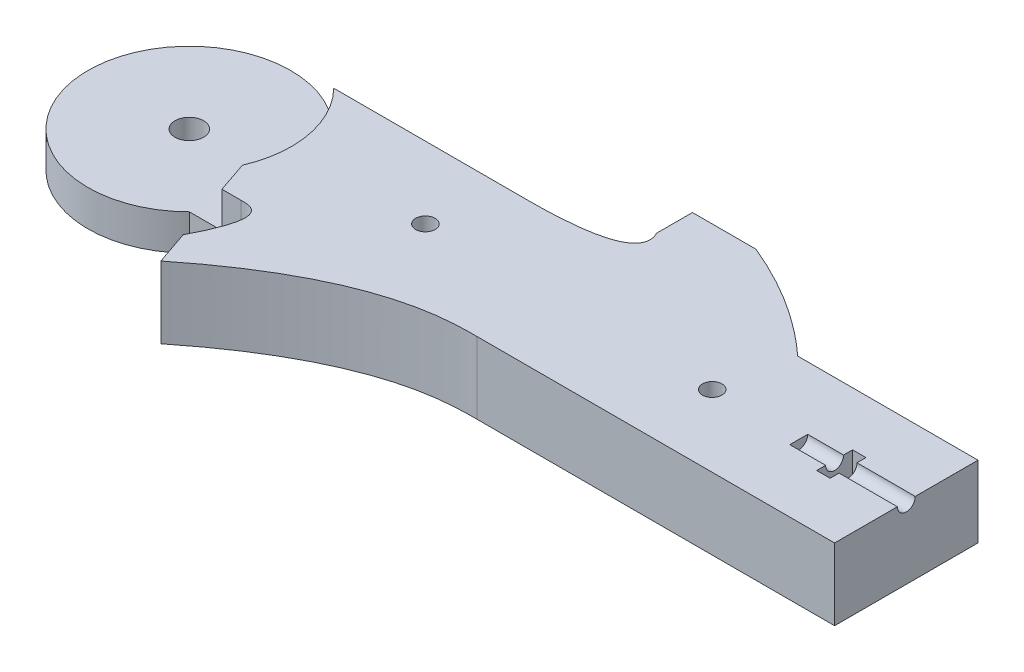
ISO-10303-21;
HEADER;
FILE_DESCRIPTION(('STEP AP214'),'2;1');
FILE_NAME('part.step','',(''),(''),'','','');
FILE_SCHEMA(('AUTOMOTIVE_DESIGN { 1 0 10303 214 1 1 1 1 }'));
ENDSEC;
DATA;
#1=APPLICATION_CONTEXT('core data for automotive mechanical design processes');
#2=APPLICATION_PROTOCOL_DEFINITION('international standard','automotive_design',2000,#1);
#3=PRODUCT_CONTEXT('',#1,'mechanical');
#4=PRODUCT('Part','Part','',(#3));
#5=PRODUCT_RELATED_PRODUCT_CATEGORY('part','',(#4));
#6=PRODUCT_DEFINITION_FORMATION('','',#4);
#7=PRODUCT_DEFINITION_CONTEXT('part definition',#1,'design');
#8=PRODUCT_DEFINITION('design','',#6,#7);
#9=PRODUCT_DEFINITION_SHAPE('','',#8);
#10=(LENGTH_UNIT() NAMED_UNIT(*) SI_UNIT(.MILLI.,.METRE.));
#11=(NAMED_UNIT(*) PLANE_ANGLE_UNIT() SI_UNIT($,.RADIAN.));
#12=(NAMED_UNIT(*) SI_UNIT($,.STERADIAN.) SOLID_ANGLE_UNIT());
#13=UNCERTAINTY_MEASURE_WITH_UNIT(LENGTH_MEASURE(1.E-05),#10,'distance_accuracy_value','');
#14=(GEOMETRIC_REPRESENTATION_CONTEXT(3) GLOBAL_UNCERTAINTY_ASSIGNED_CONTEXT((#13)) GLOBAL_UNIT_ASSIGNED_CONTEXT((#10,
#11,#12)) REPRESENTATION_CONTEXT('',''));
#15=CARTESIAN_POINT('',(0.,0.,0.));
#16=DIRECTION('',(0.,0.,1.));
#17=DIRECTION('',(1.,0.,0.));
#18=AXIS2_PLACEMENT_3D('',#15,#16,#17);
#19=CARTESIAN_POINT('',(-56.5620370370371,12.7,-6.10151852993586));
#20=DIRECTION('',(0.,0.,1.));
#21=DIRECTION('',(1.,0.,0.));
#22=AXIS2_PLACEMENT_3D('',#19,#20,#21);
#23=PLANE('',#22);
#24=DIRECTION('',(0.,1.,0.));
#25=VECTOR('',#24,1.);
#26=CARTESIAN_POINT('',(-22.0521428441884,-49.5130237421217,-6.10151852993586));
#27=LINE('',#26,#25);
#28=CARTESIAN_POINT('',(-22.0521428441884,0.,-6.10151852993586));
#29=VERTEX_POINT('',#28);
#30=CARTESIAN_POINT('',(-22.0521428441884,12.7,-6.10151852993586));
#31=VERTEX_POINT('',#30);
#32=EDGE_CURVE('E211',#29,#31,#27,.T.);
#33=ORIENTED_EDGE('',*,*,#32,.F.);
#34=DIRECTION('',(-1.,0.,0.));
#35=VECTOR('',#34,1.);
#36=CARTESIAN_POINT('',(-56.5620370370371,0.,-6.10151852993586));
#37=LINE('',#36,#35);
#38=CARTESIAN_POINT('',(-56.5620370370371,0.,-6.10151852993586));
#39=VERTEX_POINT('',#38);
#40=EDGE_CURVE('E410',#29,#39,#37,.T.);
#41=ORIENTED_EDGE('',*,*,#40,.T.);
#42=DIRECTION('',(0.,-1.,0.));
#43=VECTOR('',#42,1.);
#44=CARTESIAN_POINT('',(-56.5620370370371,12.7,-6.10151852993586));
#45=LINE('',#44,#43);
#46=CARTESIAN_POINT('',(-56.5620370370371,6.35,-6.10151852993585));
#47=VERTEX_POINT('',#46);
#48=EDGE_CURVE('E426',#47,#39,#45,.T.);
#49=ORIENTED_EDGE('',*,*,#48,.F.);
#50=DIRECTION('',(-1.,0.,0.));
#51=VECTOR('',#50,1.);
#52=CARTESIAN_POINT('',(-56.5620370370371,6.35,-6.10151852993586));
#53=LINE('',#52,#51);
#54=CARTESIAN_POINT('',(-56.3690348168402,6.35,-6.10151852993586));
#55=VERTEX_POINT('',#54);
#56=EDGE_CURVE('E386',#55,#47,#53,.T.);
#57=ORIENTED_EDGE('',*,*,#56,.F.);
#58=DIRECTION('',(0.,1.,0.));
#59=VECTOR('',#58,1.);
#60=CARTESIAN_POINT('',(-56.3690348168402,6.35,-6.10151852993586));
#61=LINE('',#60,#59);
#62=CARTESIAN_POINT('',(-56.3690348168402,12.7,-6.10151852993586));
#63=VERTEX_POINT('',#62);
#64=EDGE_CURVE('E389',#55,#63,#61,.T.);
#65=ORIENTED_EDGE('',*,*,#64,.T.);
#66=DIRECTION('',(-1.,0.,0.));
#67=VECTOR('',#66,1.);
#68=CARTESIAN_POINT('',(-56.5620370370371,12.7,-6.10151852993586));
#69=LINE('',#68,#67);
#70=EDGE_CURVE('E399',#31,#63,#69,.T.);
#71=ORIENTED_EDGE('',*,*,#70,.F.);
#72=EDGE_LOOP('',(#33,#41,#49,#57,#65,#71));
#73=FACE_BOUND('',#72,.T.);
#74=ADVANCED_FACE('F37',(#73),#23,.F.);
#75=DIRECTION('',(0.,1.,0.));
#76=VECTOR('',#75,1.);
#77=CARTESIAN_POINT('',(25.8044086413491,-49.5130237421217,-6.10151852993586));
#78=LINE('',#77,#76);
#79=CARTESIAN_POINT('',(25.8044086413491,0.,-6.10151852993586));
#80=VERTEX_POINT('',#79);
#81=CARTESIAN_POINT('',(25.8044086413491,12.7,-6.10151852993586));
#82=VERTEX_POINT('',#81);
#83=EDGE_CURVE('E247',#80,#82,#78,.T.);
#84=ORIENTED_EDGE('',*,*,#83,.T.);
#85=CARTESIAN_POINT('',(57.7379629629629,12.7,-6.10151852993586));
#86=VERTEX_POINT('',#85);
#87=EDGE_CURVE('E401',#86,#82,#69,.T.);
#88=ORIENTED_EDGE('',*,*,#87,.F.);
#89=DIRECTION('',(0.,-1.,0.));
#90=VECTOR('',#89,1.);
#91=CARTESIAN_POINT('',(57.7379629629629,12.7,-6.10151852993586));
#92=LINE('',#91,#90);
#93=CARTESIAN_POINT('',(57.7379629629629,0.,-6.10151852993586));
#94=VERTEX_POINT('',#93);
#95=EDGE_CURVE('E429',#86,#94,#92,.T.);
#96=ORIENTED_EDGE('',*,*,#95,.T.);
#97=EDGE_CURVE('E411',#94,#80,#37,.T.);
#98=ORIENTED_EDGE('',*,*,#97,.T.);
#99=EDGE_LOOP('',(#84,#88,#96,#98));
#100=FACE_BOUND('',#99,.T.);
#101=ADVANCED_FACE('F496',(#100),#23,.F.);
#102=CARTESIAN_POINT('',(-56.5620370370371,12.7,19.2984814700641));
#103=DIRECTION('',(0.,0.,-1.));
#104=DIRECTION('',(-1.,0.,0.));
#105=AXIS2_PLACEMENT_3D('',#102,#103,#104);
#106=PLANE('',#105);
#107=DIRECTION('',(0.,1.,0.));
#108=VECTOR('',#107,1.);
#109=CARTESIAN_POINT('',(-5.57588640904783,-44.9106074814327,19.2984814700641));
#110=LINE('',#109,#108);
#111=CARTESIAN_POINT('',(-5.57588640904783,0.,19.2984814700641));
#112=VERTEX_POINT('',#111);
#113=CARTESIAN_POINT('',(-5.57588640904783,12.7,19.2984814700641));
#114=VERTEX_POINT('',#113);
#115=EDGE_CURVE('E615',#112,#114,#110,.T.);
#116=ORIENTED_EDGE('',*,*,#115,.F.);
#117=DIRECTION('',(1.,0.,0.));
#118=VECTOR('',#117,1.);
#119=CARTESIAN_POINT('',(-56.5620370370371,0.,19.2984814700641));
#120=LINE('',#119,#118);
#121=CARTESIAN_POINT('',(57.7379629629629,0.,19.2984814700641));
#122=VERTEX_POINT('',#121);
#123=EDGE_CURVE('E417',#112,#122,#120,.T.);
#124=ORIENTED_EDGE('',*,*,#123,.T.);
#125=DIRECTION('',(0.,-1.,0.));
#126=VECTOR('',#125,1.);
#127=CARTESIAN_POINT('',(57.7379629629629,12.7,19.2984814700641));
#128=LINE('',#127,#126);
#129=CARTESIAN_POINT('',(57.7379629629629,12.7,19.2984814700641));
#130=VERTEX_POINT('',#129);
#131=EDGE_CURVE('E408',#130,#122,#128,.T.);
#132=ORIENTED_EDGE('',*,*,#131,.F.);
#133=DIRECTION('',(1.,0.,0.));
#134=VECTOR('',#133,1.);
#135=CARTESIAN_POINT('',(-56.5620370370371,12.7,19.2984814700641));
#136=LINE('',#135,#134);
#137=EDGE_CURVE('E404',#114,#130,#136,.T.);
#138=ORIENTED_EDGE('',*,*,#137,.F.);
#139=EDGE_LOOP('',(#116,#124,#132,#138));
#140=FACE_BOUND('',#139,.T.);
#141=ADVANCED_FACE('F501',(#140),#106,.F.);
#142=CARTESIAN_POINT('',(38.6879629629629,12.7,6.59848147006414));
#143=DIRECTION('',(1.,0.,0.));
#144=DIRECTION('',(0.,0.,-1.));
#145=AXIS2_PLACEMENT_3D('',#142,#143,#144);
#146=CYLINDRICAL_SURFACE('',#145,1.5875);
#147=DIRECTION('',(1.,0.,0.));
#148=VECTOR('',#147,1.);
#149=CARTESIAN_POINT('',(38.6879629629629,12.7,8.18598147006414));
#150=LINE('',#149,#148);
#151=CARTESIAN_POINT('',(45.0379629629629,12.7,8.18598147006414));
#152=VERTEX_POINT('',#151);
#153=CARTESIAN_POINT('',(38.6879629629629,12.7,8.18598147006414));
#154=VERTEX_POINT('',#153);
#155=EDGE_CURVE('E344',#152,#154,#150,.F.);
#156=ORIENTED_EDGE('',*,*,#155,.F.);
#157=CARTESIAN_POINT('',(45.0379629629629,12.7,6.59848147006414));
#158=DIRECTION('',(-1.,0.,0.));
#159=DIRECTION('',(0.,0.,1.));
#160=AXIS2_PLACEMENT_3D('',#157,#158,#159);
#161=CIRCLE('',#160,1.5875);
#162=CARTESIAN_POINT('',(45.0379629629629,12.7,5.01098147006415));
#163=VERTEX_POINT('',#162);
#164=EDGE_CURVE('E11',#152,#163,#161,.F.);
#165=ORIENTED_EDGE('',*,*,#164,.T.);
#166=DIRECTION('',(1.,0.,0.));
#167=VECTOR('',#166,1.);
#168=CARTESIAN_POINT('',(38.6879629629629,12.7,5.01098147006414));
#169=LINE('',#168,#167);
#170=CARTESIAN_POINT('',(38.6879629629629,12.7,5.01098147006414));
#171=VERTEX_POINT('',#170);
#172=EDGE_CURVE('E349',#171,#163,#169,.T.);
#173=ORIENTED_EDGE('',*,*,#172,.F.);
#174=CARTESIAN_POINT('',(38.6879629629629,12.7,6.59848147006414));
#175=DIRECTION('',(1.,0.,0.));
#176=DIRECTION('',(0.,0.,-1.));
#177=AXIS2_PLACEMENT_3D('',#174,#175,#176);
#178=CIRCLE('',#177,1.5875);
#179=EDGE_CURVE('E341',#154,#171,#178,.T.);
#180=ORIENTED_EDGE('',*,*,#179,.F.);
#181=EDGE_LOOP('',(#156,#165,#173,#180));
#182=FACE_BOUND('',#181,.T.);
#183=ADVANCED_FACE('F479',(#182),#146,.F.);
#184=CARTESIAN_POINT('',(-69.262037037037,12.7,6.59848147006414));
#185=DIRECTION('',(0.,-1.,0.));
#186=DIRECTION('',(0.,0.,-1.));
#187=AXIS2_PLACEMENT_3D('',#184,#185,#186);
#188=CYLINDRICAL_SURFACE('',#187,17.9605122421383);
#189=CARTESIAN_POINT('',(-69.262037037037,6.35,6.59848147006414));
#190=DIRECTION('',(0.,1.,0.));
#191=DIRECTION('',(0.,0.,1.));
#192=AXIS2_PLACEMENT_3D('',#189,#190,#191);
#193=CIRCLE('',#192,17.9605122421383);
#194=CARTESIAN_POINT('',(-56.5620370370371,6.35,19.2984814700641));
#195=VERTEX_POINT('',#194);
#196=EDGE_CURVE('E383',#47,#195,#193,.T.);
#197=ORIENTED_EDGE('',*,*,#196,.F.);
#198=ORIENTED_EDGE('',*,*,#48,.T.);
#199=CARTESIAN_POINT('',(-69.262037037037,0.,6.59848147006414));
#200=DIRECTION('',(0.,1.,0.));
#201=DIRECTION('',(0.,0.,-1.));
#202=AXIS2_PLACEMENT_3D('',#199,#200,#201);
#203=CIRCLE('',#202,17.9605122421383);
#204=CARTESIAN_POINT('',(-56.5620370370371,0.,19.2984814700641));
#205=VERTEX_POINT('',#204);
#206=EDGE_CURVE('E414',#39,#205,#203,.T.);
#207=ORIENTED_EDGE('',*,*,#206,.T.);
#208=DIRECTION('',(0.,-1.,0.));
#209=VECTOR('',#208,1.);
#210=CARTESIAN_POINT('',(-56.5620370370371,12.7,19.2984814700641));
#211=LINE('',#210,#209);
#212=EDGE_CURVE('E423',#195,#205,#211,.T.);
#213=ORIENTED_EDGE('',*,*,#212,.F.);
#214=EDGE_LOOP('',(#197,#198,#207,#213));
#215=FACE_BOUND('',#214,.T.);
#216=ADVANCED_FACE('F504',(#215),#188,.T.);
#217=CARTESIAN_POINT('',(-69.262037037037,12.7,6.59848147006414));
#218=DIRECTION('',(0.,-1.,0.));
#219=DIRECTION('',(0.,0.,-1.));
#220=AXIS2_PLACEMENT_3D('',#217,#218,#219);
#221=CYLINDRICAL_SURFACE('',#220,2.54);
#222=CARTESIAN_POINT('',(-69.262037037037,0.,6.59848147006414));
#223=DIRECTION('',(0.,1.,0.));
#224=DIRECTION('',(0.,0.,1.));
#225=AXIS2_PLACEMENT_3D('',#222,#223,#224);
#226=CIRCLE('',#225,2.54);
#227=CARTESIAN_POINT('',(-69.262037037037,0.,9.13848147006414));
#228=VERTEX_POINT('',#227);
#229=EDGE_CURVE('E392',#228,#228,#226,.T.);
#230=ORIENTED_EDGE('',*,*,#229,.F.);
#231=EDGE_LOOP('',(#230));
#232=FACE_BOUND('',#231,.T.);
#233=CARTESIAN_POINT('',(-69.262037037037,6.35,6.59848147006414));
#234=DIRECTION('',(0.,1.,0.));
#235=DIRECTION('',(0.,0.,1.));
#236=AXIS2_PLACEMENT_3D('',#233,#234,#235);
#237=CIRCLE('',#236,2.54);
#238=CARTESIAN_POINT('',(-69.262037037037,6.35,9.13848147006414));
#239=VERTEX_POINT('',#238);
#240=EDGE_CURVE('E378',#239,#239,#237,.T.);
#241=ORIENTED_EDGE('',*,*,#240,.T.);
#242=EDGE_LOOP('',(#241));
#243=FACE_BOUND('',#242,.T.);
#244=ADVANCED_FACE('F507',(#232,#243),#221,.F.);
#245=CARTESIAN_POINT('',(-69.262037037037,12.7,6.59848147006414));
#246=DIRECTION('',(0.,-1.,0.));
#247=DIRECTION('',(0.,0.,-1.));
#248=AXIS2_PLACEMENT_3D('',#245,#246,#247);
#249=PLANE('',#248);
#250=CARTESIAN_POINT('',(-27.4422931581062,12.7,6.59848147006414));
#251=DIRECTION('',(0.,-1.,0.));
#252=DIRECTION('',(0.,0.,-1.));
#253=AXIS2_PLACEMENT_3D('',#250,#251,#252);
#254=CIRCLE('',#253,1.72720000000001);
#255=CARTESIAN_POINT('',(-27.4422931581062,12.7,4.87128147006413));
#256=VERTEX_POINT('',#255);
#257=EDGE_CURVE('E360',#256,#256,#254,.T.);
#258=ORIENTED_EDGE('',*,*,#257,.T.);
#259=EDGE_LOOP('',(#258));
#260=FACE_BOUND('',#259,.T.);
#261=CARTESIAN_POINT('',(23.3577068418938,12.7,6.59848147006414));
#262=DIRECTION('',(0.,-1.,0.));
#263=DIRECTION('',(0.,0.,-1.));
#264=AXIS2_PLACEMENT_3D('',#261,#262,#263);
#265=CIRCLE('',#264,1.72720000000001);
#266=CARTESIAN_POINT('',(23.3577068418938,12.7,4.87128147006413));
#267=VERTEX_POINT('',#266);
#268=EDGE_CURVE('E372',#267,#267,#265,.T.);
#269=ORIENTED_EDGE('',*,*,#268,.T.);
#270=EDGE_LOOP('',(#269));
#271=FACE_BOUND('',#270,.T.);
#272=ORIENTED_EDGE('',*,*,#172,.T.);
#273=DIRECTION('',(0.,0.,1.));
#274=VECTOR('',#273,1.);
#275=CARTESIAN_POINT('',(45.0379629629629,12.7,9.77348147006416));
#276=LINE('',#275,#274);
#277=CARTESIAN_POINT('',(45.0379629629629,12.7,3.42348147006413));
#278=VERTEX_POINT('',#277);
#279=EDGE_CURVE('E321',#278,#163,#276,.T.);
#280=ORIENTED_EDGE('',*,*,#279,.F.);
#281=DIRECTION('',(-1.,0.,0.));
#282=VECTOR('',#281,1.);
#283=CARTESIAN_POINT('',(45.0379629629629,12.7,3.42348147006413));
#284=LINE('',#283,#282);
#285=CARTESIAN_POINT('',(47.4192129629629,12.7,3.42348147006413));
#286=VERTEX_POINT('',#285);
#287=EDGE_CURVE('E317',#286,#278,#284,.T.);
#288=ORIENTED_EDGE('',*,*,#287,.F.);
#289=DIRECTION('',(0.,0.,-1.));
#290=VECTOR('',#289,1.);
#291=CARTESIAN_POINT('',(47.4192129629629,12.7,3.42348147006413));
#292=LINE('',#291,#290);
#293=CARTESIAN_POINT('',(47.4192129629629,12.7,5.01098147006414));
#294=VERTEX_POINT('',#293);
#295=EDGE_CURVE('E312',#294,#286,#292,.T.);
#296=ORIENTED_EDGE('',*,*,#295,.F.);
#297=CARTESIAN_POINT('',(57.7379629629629,12.7,5.01098147006414));
#298=VERTEX_POINT('',#297);
#299=EDGE_CURVE('E348',#294,#298,#169,.T.);
#300=ORIENTED_EDGE('',*,*,#299,.T.);
#301=DIRECTION('',(0.,0.,-1.));
#302=VECTOR('',#301,1.);
#303=CARTESIAN_POINT('',(57.7379629629629,12.7,-6.10151852993586));
#304=LINE('',#303,#302);
#305=EDGE_CURVE('E400',#298,#86,#304,.T.);
#306=ORIENTED_EDGE('',*,*,#305,.T.);
#307=ORIENTED_EDGE('',*,*,#87,.T.);
#308=CARTESIAN_POINT('',(5.68711721311388,12.7,-18.8015185299359));
#309=CARTESIAN_POINT('',(17.0941996057411,12.7,-14.1176448631186));
#310=CARTESIAN_POINT('',(25.8044086413491,12.7,-6.10151852993586));
#311=B_SPLINE_CURVE_WITH_KNOTS('',2,(#308,#309,#310),.UNSPECIFIED.,.F.,.F.,(3,3),(0.,
0.7699329234087),.UNSPECIFIED.);
#312=CARTESIAN_POINT('',(5.68711721311388,12.7,-18.8015185299359));
#313=VERTEX_POINT('',#312);
#314=EDGE_CURVE('E244',#313,#82,#311,.T.);
#315=ORIENTED_EDGE('',*,*,#314,.F.);
#316=DIRECTION('',(1.,0.,0.));
#317=VECTOR('',#316,1.);
#318=CARTESIAN_POINT('',(-5.54086763995443,12.7,-18.8015185299359));
#319=LINE('',#318,#317);
#320=CARTESIAN_POINT('',(-5.54086763995443,12.7,-18.8015185299359));
#321=VERTEX_POINT('',#320);
#322=EDGE_CURVE('E207',#321,#313,#319,.T.);
#323=ORIENTED_EDGE('',*,*,#322,.F.);
#324=DIRECTION('',(0.,0.,-1.));
#325=VECTOR('',#324,1.);
#326=CARTESIAN_POINT('',(-5.54086763995443,12.7,-12.4515185299359));
#327=LINE('',#326,#325);
#328=CARTESIAN_POINT('',(-5.54086763995443,12.7,-12.4515185299359));
#329=VERTEX_POINT('',#328);
#330=EDGE_CURVE('E203',#329,#321,#327,.T.);
#331=ORIENTED_EDGE('',*,*,#330,.F.);
#332=CARTESIAN_POINT('',(-5.54086763995443,12.7,-12.4515185299359));
#333=CARTESIAN_POINT('',(-2.45676013605589,12.7,-6.10151852993586));
#334=CARTESIAN_POINT('',(-22.0521428441884,12.7,-6.10151852993586));
#335=B_SPLINE_CURVE_WITH_KNOTS('',2,(#332,#333,#334),.UNSPECIFIED.,.F.,.F.,(3,3),(0.,1.),.UNSPECIFIED.);
#336=EDGE_CURVE('E60',#329,#31,#335,.T.);
#337=ORIENTED_EDGE('',*,*,#336,.T.);
#338=ORIENTED_EDGE('',*,*,#70,.T.);
#339=CARTESIAN_POINT('',(-69.262037037037,12.7,6.59848147006414));
#340=DIRECTION('',(0.,1.,0.));
#341=DIRECTION('',(0.,0.,1.));
#342=AXIS2_PLACEMENT_3D('',#339,#340,#341);
#343=CIRCLE('',#342,18.0975);
#344=CARTESIAN_POINT('',(-52.6576296854306,12.7,13.796617531012));
#345=VERTEX_POINT('',#344);
#346=EDGE_CURVE('E375',#345,#63,#343,.T.);
#347=ORIENTED_EDGE('',*,*,#346,.F.);
#348=DIRECTION('',(-0.322805874294675,0.,-0.946465196148728));
#349=VECTOR('',#348,1.);
#350=CARTESIAN_POINT('',(-50.7811380761005,12.7,19.2984814700641));
#351=LINE('',#350,#349);
#352=CARTESIAN_POINT('',(-50.7811380761005,12.7,19.2984814700641));
#353=VERTEX_POINT('',#352);
#354=EDGE_CURVE('E332',#353,#345,#351,.T.);
#355=ORIENTED_EDGE('',*,*,#354,.F.);
#356=CARTESIAN_POINT('',(-47.3781705248904,12.7,19.2984814700641));
#357=VERTEX_POINT('',#356);
#358=EDGE_CURVE('E405',#353,#357,#136,.T.);
#359=ORIENTED_EDGE('',*,*,#358,.T.);
#360=CARTESIAN_POINT('',(-47.2315525581981,12.7,29.7058483148863));
#361=CARTESIAN_POINT('',(-41.7251153372007,12.7,19.2984814700641));
#362=CARTESIAN_POINT('',(-45.408751787825,12.7,19.2984814700641));
#363=CARTESIAN_POINT('',(-47.3781705248904,12.7,19.2984814700641));
#364=B_SPLINE_CURVE_WITH_KNOTS('',3,(#360,#361,#362,#363),.UNSPECIFIED.,.F.,.F.,(4,4),(0.,1.),.UNSPECIFIED.);
#365=CARTESIAN_POINT('',(-47.2315525581981,12.7,29.7058483148863));
#366=VERTEX_POINT('',#365);
#367=EDGE_CURVE('E597',#366,#357,#364,.T.);
#368=ORIENTED_EDGE('',*,*,#367,.F.);
#369=DIRECTION('',(-0.322805874294675,0.,-0.946465196148728));
#370=VECTOR('',#369,1.);
#371=CARTESIAN_POINT('',(-45.1817352564269,12.7,35.7159023104307));
#372=LINE('',#371,#370);
#373=CARTESIAN_POINT('',(-45.1817352564269,12.7,35.7159023104307));
#374=VERTEX_POINT('',#373);
#375=EDGE_CURVE('E313',#374,#366,#372,.T.);
#376=ORIENTED_EDGE('',*,*,#375,.F.);
#377=CARTESIAN_POINT('',(-45.1817352564269,12.7,35.7159023104307));
#378=CARTESIAN_POINT('',(-24.6245664486509,12.7,19.2984814700641));
#379=CARTESIAN_POINT('',(-11.56568916727,12.7,19.2984814700641));
#380=CARTESIAN_POINT('',(-5.57588640904783,12.7,19.2984814700641));
#381=B_SPLINE_CURVE_WITH_KNOTS('',3,(#377,#378,#379,#380),.UNSPECIFIED.,.F.,.F.,(4,4),(0.,1.),.UNSPECIFIED.);
#382=EDGE_CURVE('E605',#374,#114,#381,.T.);
#383=ORIENTED_EDGE('',*,*,#382,.T.);
#384=ORIENTED_EDGE('',*,*,#137,.T.);
#385=CARTESIAN_POINT('',(57.7379629629629,12.7,8.18598147006414));
#386=VERTEX_POINT('',#385);
#387=EDGE_CURVE('E396',#130,#386,#304,.T.);
#388=ORIENTED_EDGE('',*,*,#387,.T.);
#389=CARTESIAN_POINT('',(47.4192129629629,12.7,8.18598147006414));
#390=VERTEX_POINT('',#389);
#391=EDGE_CURVE('E345',#386,#390,#150,.F.);
#392=ORIENTED_EDGE('',*,*,#391,.T.);
#393=CARTESIAN_POINT('',(47.4192129629629,12.7,9.77348147006416));
#394=VERTEX_POINT('',#393);
#395=EDGE_CURVE('E314',#394,#390,#292,.T.);
#396=ORIENTED_EDGE('',*,*,#395,.F.);
#397=DIRECTION('',(1.,0.,0.));
#398=VECTOR('',#397,1.);
#399=CARTESIAN_POINT('',(45.0379629629629,12.7,9.77348147006416));
#400=LINE('',#399,#398);
#401=CARTESIAN_POINT('',(45.0379629629629,12.7,9.77348147006416));
#402=VERTEX_POINT('',#401);
#403=EDGE_CURVE('E309',#402,#394,#400,.T.);
#404=ORIENTED_EDGE('',*,*,#403,.F.);
#405=EDGE_CURVE('E320',#152,#402,#276,.T.);
#406=ORIENTED_EDGE('',*,*,#405,.F.);
#407=ORIENTED_EDGE('',*,*,#155,.T.);
#408=DIRECTION('',(0.,0.,1.));
#409=VECTOR('',#408,1.);
#410=CARTESIAN_POINT('',(38.6879629629629,12.7,6.59848147006414));
#411=LINE('',#410,#409);
#412=EDGE_CURVE('E436',#171,#154,#411,.T.);
#413=ORIENTED_EDGE('',*,*,#412,.F.);
#414=EDGE_LOOP('',(#272,#280,#288,#296,#300,#306,#307,#315,#323,#331,#337,#338,#347,#355,#359,
#368,#376,#383,#384,#388,#392,#396,#404,#406,#407,#413));
#415=FACE_BOUND('',#414,.T.);
#416=ADVANCED_FACE('F215',(#260,#271,#415),#249,.F.);
#417=CARTESIAN_POINT('',(-69.262037037037,0.,6.59848147006414));
#418=DIRECTION('',(0.,-1.,0.));
#419=DIRECTION('',(0.,0.,-1.));
#420=AXIS2_PLACEMENT_3D('',#417,#418,#419);
#421=PLANE('',#420);
#422=CARTESIAN_POINT('',(-27.4422931581062,0.,6.59848147006414));
#423=DIRECTION('',(0.,-1.,0.));
#424=DIRECTION('',(0.,0.,-1.));
#425=AXIS2_PLACEMENT_3D('',#422,#423,#424);
#426=CIRCLE('',#425,3.77062999999999);
#427=CARTESIAN_POINT('',(-27.4422931581062,0.,2.82785147006415));
#428=VERTEX_POINT('',#427);
#429=EDGE_CURVE('E351',#428,#428,#426,.T.);
#430=ORIENTED_EDGE('',*,*,#429,.F.);
#431=EDGE_LOOP('',(#430));
#432=FACE_BOUND('',#431,.T.);
#433=CARTESIAN_POINT('',(23.3577068418938,0.,6.59848147006414));
#434=DIRECTION('',(0.,-1.,0.));
#435=DIRECTION('',(0.,0.,-1.));
#436=AXIS2_PLACEMENT_3D('',#433,#434,#435);
#437=CIRCLE('',#436,3.77062999999999);
#438=CARTESIAN_POINT('',(23.3577068418938,0.,2.82785147006415));
#439=VERTEX_POINT('',#438);
#440=EDGE_CURVE('E363',#439,#439,#437,.T.);
#441=ORIENTED_EDGE('',*,*,#440,.F.);
#442=EDGE_LOOP('',(#441));
#443=FACE_BOUND('',#442,.T.);
#444=DIRECTION('',(0.,0.,-1.));
#445=VECTOR('',#444,1.);
#446=CARTESIAN_POINT('',(57.7379629629629,0.,-6.10151852993586));
#447=LINE('',#446,#445);
#448=EDGE_CURVE('E395',#122,#94,#447,.T.);
#449=ORIENTED_EDGE('',*,*,#448,.F.);
#450=ORIENTED_EDGE('',*,*,#123,.F.);
#451=CARTESIAN_POINT('',(-45.1817352564269,0.,35.7159023104307));
#452=CARTESIAN_POINT('',(-24.6245664486509,0.,19.2984814700641));
#453=CARTESIAN_POINT('',(-11.56568916727,0.,19.2984814700641));
#454=CARTESIAN_POINT('',(-5.57588640904783,0.,19.2984814700641));
#455=B_SPLINE_CURVE_WITH_KNOTS('',3,(#451,#452,#453,#454),.UNSPECIFIED.,.F.,.F.,(4,4),(0.,1.),.UNSPECIFIED.);
#456=CARTESIAN_POINT('',(-45.1817352564269,0.,35.7159023104307));
#457=VERTEX_POINT('',#456);
#458=EDGE_CURVE('E612',#457,#112,#455,.T.);
#459=ORIENTED_EDGE('',*,*,#458,.F.);
#460=DIRECTION('',(-0.322805874294675,0.,-0.946465196148728));
#461=VECTOR('',#460,1.);
#462=CARTESIAN_POINT('',(-45.1817352564269,0.,35.7159023104307));
#463=LINE('',#462,#461);
#464=CARTESIAN_POINT('',(-47.2315525581981,0.,29.7058483148863));
#465=VERTEX_POINT('',#464);
#466=EDGE_CURVE('E218',#457,#465,#463,.T.);
#467=ORIENTED_EDGE('',*,*,#466,.T.);
#468=CARTESIAN_POINT('',(-47.2315525581981,0.,29.7058483148863));
#469=CARTESIAN_POINT('',(-41.7251153372007,0.,19.2984814700641));
#470=CARTESIAN_POINT('',(-45.408751787825,0.,19.2984814700641));
#471=CARTESIAN_POINT('',(-47.3781705248904,0.,19.2984814700641));
#472=B_SPLINE_CURVE_WITH_KNOTS('',3,(#468,#469,#470,#471),.UNSPECIFIED.,.F.,.F.,(4,4),(0.,1.),.UNSPECIFIED.);
#473=CARTESIAN_POINT('',(-47.3781705248904,0.,19.2984814700641));
#474=VERTEX_POINT('',#473);
#475=EDGE_CURVE('E221',#465,#474,#472,.T.);
#476=ORIENTED_EDGE('',*,*,#475,.T.);
#477=EDGE_CURVE('E418',#205,#474,#120,.T.);
#478=ORIENTED_EDGE('',*,*,#477,.F.);
#479=ORIENTED_EDGE('',*,*,#206,.F.);
#480=ORIENTED_EDGE('',*,*,#40,.F.);
#481=CARTESIAN_POINT('',(-5.54086763995443,0.,-12.4515185299359));
#482=CARTESIAN_POINT('',(-2.45676013605589,0.,-6.10151852993586));
#483=CARTESIAN_POINT('',(-22.0521428441884,0.,-6.10151852993586));
#484=B_SPLINE_CURVE_WITH_KNOTS('',2,(#481,#482,#483),.UNSPECIFIED.,.F.,.F.,(3,3),(0.,1.),.UNSPECIFIED.);
#485=CARTESIAN_POINT('',(-5.54086763995443,0.,-12.4515185299359));
#486=VERTEX_POINT('',#485);
#487=EDGE_CURVE('E52',#486,#29,#484,.T.);
#488=ORIENTED_EDGE('',*,*,#487,.F.);
#489=DIRECTION('',(0.,0.,-1.));
#490=VECTOR('',#489,1.);
#491=CARTESIAN_POINT('',(-5.54086763995443,0.,-12.4515185299359));
#492=LINE('',#491,#490);
#493=CARTESIAN_POINT('',(-5.54086763995443,0.,-18.8015185299359));
#494=VERTEX_POINT('',#493);
#495=EDGE_CURVE('E206',#486,#494,#492,.T.);
#496=ORIENTED_EDGE('',*,*,#495,.T.);
#497=DIRECTION('',(1.,0.,0.));
#498=VECTOR('',#497,1.);
#499=CARTESIAN_POINT('',(-5.54086763995443,0.,-18.8015185299359));
#500=LINE('',#499,#498);
#501=CARTESIAN_POINT('',(5.68711721311388,0.,-18.8015185299359));
#502=VERTEX_POINT('',#501);
#503=EDGE_CURVE('E233',#494,#502,#500,.T.);
#504=ORIENTED_EDGE('',*,*,#503,.T.);
#505=CARTESIAN_POINT('',(5.68711721311388,0.,-18.8015185299359));
#506=CARTESIAN_POINT('',(17.0941996057411,0.,-14.1176448631186));
#507=CARTESIAN_POINT('',(25.8044086413491,0.,-6.10151852993586));
#508=B_SPLINE_CURVE_WITH_KNOTS('',2,(#505,#506,#507),.UNSPECIFIED.,.F.,.F.,(3,3),(0.,
0.7699329234087),.UNSPECIFIED.);
#509=EDGE_CURVE('E212',#502,#80,#508,.T.);
#510=ORIENTED_EDGE('',*,*,#509,.T.);
#511=ORIENTED_EDGE('',*,*,#97,.F.);
#512=EDGE_LOOP('',(#449,#450,#459,#467,#476,#478,#479,#480,#488,#496,#504,#510,#511));
#513=FACE_BOUND('',#512,.T.);
#514=ORIENTED_EDGE('',*,*,#229,.T.);
#515=EDGE_LOOP('',(#514));
#516=FACE_BOUND('',#515,.T.);
#517=ADVANCED_FACE('F514',(#432,#443,#513,#516),#421,.T.);
#518=CARTESIAN_POINT('',(57.7379629629629,12.7,-6.10151852993586));
#519=DIRECTION('',(-1.,0.,0.));
#520=DIRECTION('',(0.,0.,1.));
#521=AXIS2_PLACEMENT_3D('',#518,#519,#520);
#522=PLANE('',#521);
#523=ORIENTED_EDGE('',*,*,#305,.F.);
#524=CARTESIAN_POINT('',(57.7379629629629,12.7,6.59848147006414));
#525=DIRECTION('',(-1.,0.,0.));
#526=DIRECTION('',(0.,0.,1.));
#527=AXIS2_PLACEMENT_3D('',#524,#525,#526);
#528=CIRCLE('',#527,1.5875);
#529=EDGE_CURVE('E432',#298,#386,#528,.T.);
#530=ORIENTED_EDGE('',*,*,#529,.T.);
#531=ORIENTED_EDGE('',*,*,#387,.F.);
#532=ORIENTED_EDGE('',*,*,#131,.T.);
#533=ORIENTED_EDGE('',*,*,#448,.T.);
#534=ORIENTED_EDGE('',*,*,#95,.F.);
#535=EDGE_LOOP('',(#523,#530,#531,#532,#533,#534));
#536=FACE_BOUND('',#535,.T.);
#537=ADVANCED_FACE('F39',(#536),#522,.F.);
#538=ORIENTED_EDGE('',*,*,#477,.T.);
#539=DIRECTION('',(0.,1.,0.));
#540=VECTOR('',#539,1.);
#541=CARTESIAN_POINT('',(-47.3781705248904,-44.9106074814327,19.2984814700641));
#542=LINE('',#541,#540);
#543=EDGE_CURVE('E593',#474,#357,#542,.T.);
#544=ORIENTED_EDGE('',*,*,#543,.T.);
#545=ORIENTED_EDGE('',*,*,#358,.F.);
#546=DIRECTION('',(0.,1.,0.));
#547=VECTOR('',#546,1.);
#548=CARTESIAN_POINT('',(-50.7811380761005,-2.73699166155966,19.2984814700641));
#549=LINE('',#548,#547);
#550=CARTESIAN_POINT('',(-50.7811380761005,6.35,19.2984814700641));
#551=VERTEX_POINT('',#550);
#552=EDGE_CURVE('E335',#551,#353,#549,.T.);
#553=ORIENTED_EDGE('',*,*,#552,.F.);
#554=DIRECTION('',(1.,0.,0.));
#555=VECTOR('',#554,1.);
#556=CARTESIAN_POINT('',(-56.5620370370371,6.35,19.2984814700641));
#557=LINE('',#556,#555);
#558=EDGE_CURVE('E380',#195,#551,#557,.T.);
#559=ORIENTED_EDGE('',*,*,#558,.F.);
#560=ORIENTED_EDGE('',*,*,#212,.T.);
#561=EDGE_LOOP('',(#538,#544,#545,#553,#559,#560));
#562=FACE_BOUND('',#561,.T.);
#563=ADVANCED_FACE('F509',(#562),#106,.F.);
#564=CARTESIAN_POINT('',(-69.262037037037,6.35,6.59848147006414));
#565=DIRECTION('',(0.,1.,0.));
#566=DIRECTION('',(0.,0.,1.));
#567=AXIS2_PLACEMENT_3D('',#564,#565,#566);
#568=CYLINDRICAL_SURFACE('',#567,18.0975);
#569=CARTESIAN_POINT('',(-69.262037037037,6.35,6.59848147006414));
#570=DIRECTION('',(0.,1.,0.));
#571=DIRECTION('',(0.,0.,1.));
#572=AXIS2_PLACEMENT_3D('',#569,#570,#571);
#573=CIRCLE('',#572,18.0975);
#574=CARTESIAN_POINT('',(-52.6576296854306,6.35,13.796617531012));
#575=VERTEX_POINT('',#574);
#576=EDGE_CURVE('E376',#575,#55,#573,.T.);
#577=ORIENTED_EDGE('',*,*,#576,.F.);
#578=DIRECTION('',(0.,1.,0.));
#579=VECTOR('',#578,1.);
#580=CARTESIAN_POINT('',(-52.6576296854306,-2.73699166155966,13.796617531012));
#581=LINE('',#580,#579);
#582=EDGE_CURVE('E336',#575,#345,#581,.T.);
#583=ORIENTED_EDGE('',*,*,#582,.T.);
#584=ORIENTED_EDGE('',*,*,#346,.T.);
#585=ORIENTED_EDGE('',*,*,#64,.F.);
#586=EDGE_LOOP('',(#577,#583,#584,#585));
#587=FACE_BOUND('',#586,.T.);
#588=ADVANCED_FACE('F512',(#587),#568,.F.);
#589=CARTESIAN_POINT('',(-69.262037037037,6.35,6.59848147006414));
#590=DIRECTION('',(0.,1.,0.));
#591=DIRECTION('',(0.,0.,1.));
#592=AXIS2_PLACEMENT_3D('',#589,#590,#591);
#593=PLANE('',#592);
#594=ORIENTED_EDGE('',*,*,#196,.T.);
#595=ORIENTED_EDGE('',*,*,#558,.T.);
#596=DIRECTION('',(0.322805874294675,0.,0.946465196148728));
#597=VECTOR('',#596,1.);
#598=CARTESIAN_POINT('',(-50.7811380761005,6.35,19.2984814700641));
#599=LINE('',#598,#597);
#600=EDGE_CURVE('E338',#575,#551,#599,.T.);
#601=ORIENTED_EDGE('',*,*,#600,.F.);
#602=ORIENTED_EDGE('',*,*,#576,.T.);
#603=ORIENTED_EDGE('',*,*,#56,.T.);
#604=EDGE_LOOP('',(#594,#595,#601,#602,#603));
#605=FACE_BOUND('',#604,.T.);
#606=ORIENTED_EDGE('',*,*,#240,.F.);
#607=EDGE_LOOP('',(#606));
#608=FACE_BOUND('',#607,.T.);
#609=ADVANCED_FACE('F526',(#605,#608),#593,.T.);
#610=CARTESIAN_POINT('',(23.3577068418938,0.,6.59848147006414));
#611=DIRECTION('',(0.,-1.,0.));
#612=DIRECTION('',(0.,0.,-1.));
#613=AXIS2_PLACEMENT_3D('',#610,#611,#612);
#614=CYLINDRICAL_SURFACE('',#613,1.7272);
#615=ORIENTED_EDGE('',*,*,#268,.F.);
#616=EDGE_LOOP('',(#615));
#617=FACE_BOUND('',#616,.T.);
#618=CARTESIAN_POINT('',(23.3577068418938,1.9812,6.59848147006414));
#619=DIRECTION('',(0.,-1.,0.));
#620=DIRECTION('',(0.,0.,-1.));
#621=AXIS2_PLACEMENT_3D('',#618,#619,#620);
#622=CIRCLE('',#621,1.7272);
#623=CARTESIAN_POINT('',(23.3577068418938,1.9812,4.87128147006415));
#624=VERTEX_POINT('',#623);
#625=EDGE_CURVE('E369',#624,#624,#622,.T.);
#626=ORIENTED_EDGE('',*,*,#625,.T.);
#627=EDGE_LOOP('',(#626));
#628=FACE_BOUND('',#627,.T.);
#629=ADVANCED_FACE('F530',(#617,#628),#614,.F.);
#630=CARTESIAN_POINT('',(25.0849068418938,1.9812,6.59848147006414));
#631=DIRECTION('',(0.,1.,0.));
#632=DIRECTION('',(0.,0.,1.));
#633=AXIS2_PLACEMENT_3D('',#630,#631,#632);
#634=PLANE('',#633);
#635=ORIENTED_EDGE('',*,*,#625,.F.);
#636=EDGE_LOOP('',(#635));
#637=FACE_BOUND('',#636,.T.);
#638=CARTESIAN_POINT('',(23.3577068418938,1.9812,6.59848147006414));
#639=DIRECTION('',(0.,-1.,0.));
#640=DIRECTION('',(0.,0.,-1.));
#641=AXIS2_PLACEMENT_3D('',#638,#639,#640);
#642=CIRCLE('',#641,3.77063);
#643=CARTESIAN_POINT('',(23.3577068418938,1.9812,2.82785147006415));
#644=VERTEX_POINT('',#643);
#645=EDGE_CURVE('E366',#644,#644,#642,.T.);
#646=ORIENTED_EDGE('',*,*,#645,.T.);
#647=EDGE_LOOP('',(#646));
#648=FACE_BOUND('',#647,.T.);
#649=ADVANCED_FACE('F534',(#637,#648),#634,.F.);
#650=CARTESIAN_POINT('',(23.3577068418938,0.,6.59848147006414));
#651=DIRECTION('',(0.,-1.,0.));
#652=DIRECTION('',(0.,0.,-1.));
#653=AXIS2_PLACEMENT_3D('',#650,#651,#652);
#654=CYLINDRICAL_SURFACE('',#653,3.77063);
#655=ORIENTED_EDGE('',*,*,#645,.F.);
#656=EDGE_LOOP('',(#655));
#657=FACE_BOUND('',#656,.T.);
#658=ORIENTED_EDGE('',*,*,#440,.T.);
#659=EDGE_LOOP('',(#658));
#660=FACE_BOUND('',#659,.T.);
#661=ADVANCED_FACE('F538',(#657,#660),#654,.F.);
#662=CARTESIAN_POINT('',(-27.4422931581062,0.,6.59848147006414));
#663=DIRECTION('',(0.,-1.,0.));
#664=DIRECTION('',(0.,0.,-1.));
#665=AXIS2_PLACEMENT_3D('',#662,#663,#664);
#666=CYLINDRICAL_SURFACE('',#665,1.7272);
#667=ORIENTED_EDGE('',*,*,#257,.F.);
#668=EDGE_LOOP('',(#667));
#669=FACE_BOUND('',#668,.T.);
#670=CARTESIAN_POINT('',(-27.4422931581062,1.9812,6.59848147006414));
#671=DIRECTION('',(0.,-1.,0.));
#672=DIRECTION('',(0.,0.,-1.));
#673=AXIS2_PLACEMENT_3D('',#670,#671,#672);
#674=CIRCLE('',#673,1.7272);
#675=CARTESIAN_POINT('',(-27.4422931581062,1.9812,4.87128147006415));
#676=VERTEX_POINT('',#675);
#677=EDGE_CURVE('E357',#676,#676,#674,.T.);
#678=ORIENTED_EDGE('',*,*,#677,.T.);
#679=EDGE_LOOP('',(#678));
#680=FACE_BOUND('',#679,.T.);
#681=ADVANCED_FACE('F542',(#669,#680),#666,.F.);
#682=CARTESIAN_POINT('',(-25.7150931581062,1.9812,6.59848147006414));
#683=DIRECTION('',(0.,1.,0.));
#684=DIRECTION('',(0.,0.,1.));
#685=AXIS2_PLACEMENT_3D('',#682,#683,#684);
#686=PLANE('',#685);
#687=ORIENTED_EDGE('',*,*,#677,.F.);
#688=EDGE_LOOP('',(#687));
#689=FACE_BOUND('',#688,.T.);
#690=CARTESIAN_POINT('',(-27.4422931581062,1.9812,6.59848147006414));
#691=DIRECTION('',(0.,-1.,0.));
#692=DIRECTION('',(0.,0.,-1.));
#693=AXIS2_PLACEMENT_3D('',#690,#691,#692);
#694=CIRCLE('',#693,3.77063);
#695=CARTESIAN_POINT('',(-27.4422931581062,1.9812,2.82785147006415));
#696=VERTEX_POINT('',#695);
#697=EDGE_CURVE('E354',#696,#696,#694,.T.);
#698=ORIENTED_EDGE('',*,*,#697,.T.);
#699=EDGE_LOOP('',(#698));
#700=FACE_BOUND('',#699,.T.);
#701=ADVANCED_FACE('F491',(#689,#700),#686,.F.);
#702=CARTESIAN_POINT('',(-27.4422931581062,0.,6.59848147006414));
#703=DIRECTION('',(0.,-1.,0.));
#704=DIRECTION('',(0.,0.,-1.));
#705=AXIS2_PLACEMENT_3D('',#702,#703,#704);
#706=CYLINDRICAL_SURFACE('',#705,3.77063);
#707=ORIENTED_EDGE('',*,*,#697,.F.);
#708=EDGE_LOOP('',(#707));
#709=FACE_BOUND('',#708,.T.);
#710=ORIENTED_EDGE('',*,*,#429,.T.);
#711=EDGE_LOOP('',(#710));
#712=FACE_BOUND('',#711,.T.);
#713=ADVANCED_FACE('F483',(#709,#712),#706,.F.);
#714=CARTESIAN_POINT('',(38.6879629629629,12.7,6.59848147006414));
#715=DIRECTION('',(1.,0.,0.));
#716=DIRECTION('',(0.,0.,-1.));
#717=AXIS2_PLACEMENT_3D('',#714,#715,#716);
#718=PLANE('',#717);
#719=ORIENTED_EDGE('',*,*,#412,.T.);
#720=ORIENTED_EDGE('',*,*,#179,.T.);
#721=EDGE_LOOP('',(#719,#720));
#722=FACE_BOUND('',#721,.T.);
#723=ADVANCED_FACE('F481',(#722),#718,.T.);
#724=ORIENTED_EDGE('',*,*,#299,.F.);
#725=CARTESIAN_POINT('',(47.4192129629629,12.7,6.59848147006414));
#726=DIRECTION('',(1.,0.,0.));
#727=DIRECTION('',(0.,0.,-1.));
#728=AXIS2_PLACEMENT_3D('',#725,#726,#727);
#729=CIRCLE('',#728,1.5875);
#730=EDGE_CURVE('E45',#294,#390,#729,.F.);
#731=ORIENTED_EDGE('',*,*,#730,.T.);
#732=ORIENTED_EDGE('',*,*,#391,.F.);
#733=ORIENTED_EDGE('',*,*,#529,.F.);
#734=EDGE_LOOP('',(#724,#731,#732,#733));
#735=FACE_BOUND('',#734,.T.);
#736=ADVANCED_FACE('F440',(#735),#146,.F.);
#737=CARTESIAN_POINT('',(-50.7811380761005,-2.73699166155966,19.2984814700641));
#738=DIRECTION('',(0.946465196148728,0.,-0.322805874294675));
#739=DIRECTION('',(-0.322805874294675,0.,-0.946465196148728));
#740=AXIS2_PLACEMENT_3D('',#737,#738,#739);
#741=PLANE('',#740);
#742=ORIENTED_EDGE('',*,*,#600,.T.);
#743=ORIENTED_EDGE('',*,*,#552,.T.);
#744=ORIENTED_EDGE('',*,*,#354,.T.);
#745=ORIENTED_EDGE('',*,*,#582,.F.);
#746=EDGE_LOOP('',(#742,#743,#744,#745));
#747=FACE_BOUND('',#746,.T.);
#748=ADVANCED_FACE('F489',(#747),#741,.F.);
#749=CARTESIAN_POINT('',(45.0379629629629,-2.73699166155966,9.77348147006416));
#750=DIRECTION('',(-1.,0.,0.));
#751=DIRECTION('',(0.,0.,1.));
#752=AXIS2_PLACEMENT_3D('',#749,#750,#751);
#753=PLANE('',#752);
#754=ORIENTED_EDGE('',*,*,#405,.T.);
#755=DIRECTION('',(0.,1.,0.));
#756=VECTOR('',#755,1.);
#757=CARTESIAN_POINT('',(45.0379629629629,-2.73699166155966,9.77348147006416));
#758=LINE('',#757,#756);
#759=CARTESIAN_POINT('',(45.0379629629629,6.35,9.77348147006416));
#760=VERTEX_POINT('',#759);
#761=EDGE_CURVE('E303',#760,#402,#758,.T.);
#762=ORIENTED_EDGE('',*,*,#761,.F.);
#763=DIRECTION('',(0.,0.,-1.));
#764=VECTOR('',#763,1.);
#765=CARTESIAN_POINT('',(45.0379629629629,6.35,9.77348147006416));
#766=LINE('',#765,#764);
#767=CARTESIAN_POINT('',(45.0379629629629,6.35,3.42348147006413));
#768=VERTEX_POINT('',#767);
#769=EDGE_CURVE('E302',#760,#768,#766,.T.);
#770=ORIENTED_EDGE('',*,*,#769,.T.);
#771=DIRECTION('',(0.,1.,0.));
#772=VECTOR('',#771,1.);
#773=CARTESIAN_POINT('',(45.0379629629629,-2.73699166155966,3.42348147006413));
#774=LINE('',#773,#772);
#775=EDGE_CURVE('E325',#768,#278,#774,.T.);
#776=ORIENTED_EDGE('',*,*,#775,.T.);
#777=ORIENTED_EDGE('',*,*,#279,.T.);
#778=ORIENTED_EDGE('',*,*,#164,.F.);
#779=EDGE_LOOP('',(#754,#762,#770,#776,#777,#778));
#780=FACE_BOUND('',#779,.T.);
#781=ADVANCED_FACE('F475',(#780),#753,.F.);
#782=CARTESIAN_POINT('',(47.4192129629629,-2.73699166155966,3.42348147006413));
#783=DIRECTION('',(1.,0.,0.));
#784=DIRECTION('',(0.,0.,-1.));
#785=AXIS2_PLACEMENT_3D('',#782,#783,#784);
#786=PLANE('',#785);
#787=ORIENTED_EDGE('',*,*,#295,.T.);
#788=DIRECTION('',(0.,1.,0.));
#789=VECTOR('',#788,1.);
#790=CARTESIAN_POINT('',(47.4192129629629,-2.73699166155966,3.42348147006413));
#791=LINE('',#790,#789);
#792=CARTESIAN_POINT('',(47.4192129629629,6.35,3.42348147006413));
#793=VERTEX_POINT('',#792);
#794=EDGE_CURVE('E327',#793,#286,#791,.T.);
#795=ORIENTED_EDGE('',*,*,#794,.F.);
#796=DIRECTION('',(0.,0.,1.));
#797=VECTOR('',#796,1.);
#798=CARTESIAN_POINT('',(47.4192129629629,6.35,3.42348147006413));
#799=LINE('',#798,#797);
#800=CARTESIAN_POINT('',(47.4192129629629,6.35,9.77348147006416));
#801=VERTEX_POINT('',#800);
#802=EDGE_CURVE('E308',#793,#801,#799,.T.);
#803=ORIENTED_EDGE('',*,*,#802,.T.);
#804=DIRECTION('',(0.,1.,0.));
#805=VECTOR('',#804,1.);
#806=CARTESIAN_POINT('',(47.4192129629629,-2.73699166155966,9.77348147006416));
#807=LINE('',#806,#805);
#808=EDGE_CURVE('E323',#801,#394,#807,.T.);
#809=ORIENTED_EDGE('',*,*,#808,.T.);
#810=ORIENTED_EDGE('',*,*,#395,.T.);
#811=ORIENTED_EDGE('',*,*,#730,.F.);
#812=EDGE_LOOP('',(#787,#795,#803,#809,#810,#811));
#813=FACE_BOUND('',#812,.T.);
#814=ADVANCED_FACE('F446',(#813),#786,.F.);
#815=CARTESIAN_POINT('',(45.0379629629629,-2.73699166155966,9.77348147006416));
#816=DIRECTION('',(0.,0.,1.));
#817=DIRECTION('',(1.,0.,0.));
#818=AXIS2_PLACEMENT_3D('',#815,#816,#817);
#819=PLANE('',#818);
#820=DIRECTION('',(-1.,0.,0.));
#821=VECTOR('',#820,1.);
#822=CARTESIAN_POINT('',(45.0379629629629,6.35,9.77348147006416));
#823=LINE('',#822,#821);
#824=EDGE_CURVE('E306',#801,#760,#823,.T.);
#825=ORIENTED_EDGE('',*,*,#824,.T.);
#826=ORIENTED_EDGE('',*,*,#761,.T.);
#827=ORIENTED_EDGE('',*,*,#403,.T.);
#828=ORIENTED_EDGE('',*,*,#808,.F.);
#829=EDGE_LOOP('',(#825,#826,#827,#828));
#830=FACE_BOUND('',#829,.T.);
#831=ADVANCED_FACE('F469',(#830),#819,.F.);
#832=CARTESIAN_POINT('',(45.0379629629629,-2.73699166155966,3.42348147006413));
#833=DIRECTION('',(0.,0.,-1.));
#834=DIRECTION('',(-1.,0.,0.));
#835=AXIS2_PLACEMENT_3D('',#832,#833,#834);
#836=PLANE('',#835);
#837=DIRECTION('',(1.,0.,0.));
#838=VECTOR('',#837,1.);
#839=CARTESIAN_POINT('',(45.0379629629629,6.35,3.42348147006413));
#840=LINE('',#839,#838);
#841=EDGE_CURVE('E297',#768,#793,#840,.T.);
#842=ORIENTED_EDGE('',*,*,#841,.T.);
#843=ORIENTED_EDGE('',*,*,#794,.T.);
#844=ORIENTED_EDGE('',*,*,#287,.T.);
#845=ORIENTED_EDGE('',*,*,#775,.F.);
#846=EDGE_LOOP('',(#842,#843,#844,#845));
#847=FACE_BOUND('',#846,.T.);
#848=ADVANCED_FACE('F462',(#847),#836,.F.);
#849=CARTESIAN_POINT('',(-69.262037037037,6.35,6.59848147006414));
#850=DIRECTION('',(0.,1.,0.));
#851=DIRECTION('',(0.,0.,1.));
#852=AXIS2_PLACEMENT_3D('',#849,#850,#851);
#853=PLANE('',#852);
#854=ORIENTED_EDGE('',*,*,#824,.F.);
#855=ORIENTED_EDGE('',*,*,#802,.F.);
#856=ORIENTED_EDGE('',*,*,#841,.F.);
#857=ORIENTED_EDGE('',*,*,#769,.F.);
#858=EDGE_LOOP('',(#854,#855,#856,#857));
#859=FACE_BOUND('',#858,.T.);
#860=ADVANCED_FACE('F466',(#859),#853,.T.);
#861=CARTESIAN_POINT('',(-45.1817352564269,-44.9106074814327,35.7159023104307));
#862=CARTESIAN_POINT('',(-24.6245664486509,-44.9106074814327,19.2984814700641));
#863=CARTESIAN_POINT('',(-11.56568916727,-44.9106074814327,19.2984814700641));
#864=CARTESIAN_POINT('',(-5.57588640904783,-44.9106074814327,19.2984814700641));
#865=B_SPLINE_CURVE_WITH_KNOTS('',3,(#861,#862,#863,#864),.UNSPECIFIED.,.F.,.F.,(4,4),(0.,1.),.UNSPECIFIED.);
#866=DIRECTION('',(0.,1.,0.));
#867=VECTOR('',#866,1.);
#868=SURFACE_OF_LINEAR_EXTRUSION('',#865,#867);
#869=DIRECTION('',(0.,1.,0.));
#870=VECTOR('',#869,1.);
#871=CARTESIAN_POINT('',(-45.1817352564269,-44.9106074814327,35.7159023104307));
#872=LINE('',#871,#870);
#873=EDGE_CURVE('E288',#457,#374,#872,.T.);
#874=ORIENTED_EDGE('',*,*,#873,.F.);
#875=ORIENTED_EDGE('',*,*,#458,.T.);
#876=ORIENTED_EDGE('',*,*,#115,.T.);
#877=ORIENTED_EDGE('',*,*,#382,.F.);
#878=EDGE_LOOP('',(#874,#875,#876,#877));
#879=FACE_BOUND('',#878,.T.);
#880=ADVANCED_FACE('F280',(#879),#868,.T.);
#881=CARTESIAN_POINT('',(-47.2315525581981,-44.9106074814327,29.7058483148863));
#882=CARTESIAN_POINT('',(-41.7251153372007,-44.9106074814327,19.2984814700641));
#883=CARTESIAN_POINT('',(-45.408751787825,-44.9106074814327,19.2984814700641));
#884=CARTESIAN_POINT('',(-47.3781705248904,-44.9106074814327,19.2984814700641));
#885=B_SPLINE_CURVE_WITH_KNOTS('',3,(#881,#882,#883,#884),.UNSPECIFIED.,.F.,.F.,(4,4),(0.,1.),.UNSPECIFIED.);
#886=DIRECTION('',(0.,1.,0.));
#887=VECTOR('',#886,1.);
#888=SURFACE_OF_LINEAR_EXTRUSION('',#885,#887);
#889=ORIENTED_EDGE('',*,*,#475,.F.);
#890=DIRECTION('',(0.,1.,0.));
#891=VECTOR('',#890,1.);
#892=CARTESIAN_POINT('',(-47.2315525581981,-44.9106074814327,29.7058483148863));
#893=LINE('',#892,#891);
#894=EDGE_CURVE('E599',#465,#366,#893,.T.);
#895=ORIENTED_EDGE('',*,*,#894,.T.);
#896=ORIENTED_EDGE('',*,*,#367,.T.);
#897=ORIENTED_EDGE('',*,*,#543,.F.);
#898=EDGE_LOOP('',(#889,#895,#896,#897));
#899=FACE_BOUND('',#898,.T.);
#900=ADVANCED_FACE('F275',(#899),#888,.F.);
#901=CARTESIAN_POINT('',(-45.1817352564269,-44.9106074814327,35.7159023104307));
#902=DIRECTION('',(0.946465196148728,0.,-0.322805874294675));
#903=DIRECTION('',(-0.322805874294675,0.,-0.946465196148728));
#904=AXIS2_PLACEMENT_3D('',#901,#902,#903);
#905=PLANE('',#904);
#906=ORIENTED_EDGE('',*,*,#466,.F.);
#907=ORIENTED_EDGE('',*,*,#873,.T.);
#908=ORIENTED_EDGE('',*,*,#375,.T.);
#909=ORIENTED_EDGE('',*,*,#894,.F.);
#910=EDGE_LOOP('',(#906,#907,#908,#909));
#911=FACE_BOUND('',#910,.T.);
#912=ADVANCED_FACE('F272',(#911),#905,.F.);
#913=CARTESIAN_POINT('',(-5.54086763995443,-49.5130237421217,-12.4515185299359));
#914=CARTESIAN_POINT('',(-2.45676013605589,-49.5130237421217,-6.10151852993586));
#915=CARTESIAN_POINT('',(-22.0521428441884,-49.5130237421217,-6.10151852993586));
#916=B_SPLINE_CURVE_WITH_KNOTS('',2,(#913,#914,#915),.UNSPECIFIED.,.F.,.F.,(3,3),(0.,1.),.UNSPECIFIED.);
#917=DIRECTION('',(0.,1.,0.));
#918=VECTOR('',#917,1.);
#919=SURFACE_OF_LINEAR_EXTRUSION('',#916,#918);
#920=DIRECTION('',(0.,1.,0.));
#921=VECTOR('',#920,1.);
#922=CARTESIAN_POINT('',(-5.54086763995443,-49.5130237421217,-12.4515185299359));
#923=LINE('',#922,#921);
#924=EDGE_CURVE('E201',#486,#329,#923,.T.);
#925=ORIENTED_EDGE('',*,*,#924,.F.);
#926=ORIENTED_EDGE('',*,*,#487,.T.);
#927=ORIENTED_EDGE('',*,*,#32,.T.);
#928=ORIENTED_EDGE('',*,*,#336,.F.);
#929=EDGE_LOOP('',(#925,#926,#927,#928));
#930=FACE_BOUND('',#929,.T.);
#931=ADVANCED_FACE('F209',(#930),#919,.T.);
#932=CARTESIAN_POINT('',(5.68711721311388,-49.5130237421217,-18.8015185299359));
#933=CARTESIAN_POINT('',(17.0941996057411,-49.5130237421217,-14.1176448631186));
#934=CARTESIAN_POINT('',(25.8044086413491,-49.5130237421217,-6.10151852993586));
#935=B_SPLINE_CURVE_WITH_KNOTS('',2,(#932,#933,#934),.UNSPECIFIED.,.F.,.F.,(3,3),(0.,
0.7699329234087),.UNSPECIFIED.);
#936=DIRECTION('',(0.,1.,0.));
#937=VECTOR('',#936,1.);
#938=SURFACE_OF_LINEAR_EXTRUSION('',#935,#937);
#939=ORIENTED_EDGE('',*,*,#509,.F.);
#940=DIRECTION('',(0.,1.,0.));
#941=VECTOR('',#940,1.);
#942=CARTESIAN_POINT('',(5.68711721311388,-49.5130237421217,-18.8015185299359));
#943=LINE('',#942,#941);
#944=EDGE_CURVE('E245',#502,#313,#943,.T.);
#945=ORIENTED_EDGE('',*,*,#944,.T.);
#946=ORIENTED_EDGE('',*,*,#314,.T.);
#947=ORIENTED_EDGE('',*,*,#83,.F.);
#948=EDGE_LOOP('',(#939,#945,#946,#947));
#949=FACE_BOUND('',#948,.T.);
#950=ADVANCED_FACE('F263',(#949),#938,.F.);
#951=CARTESIAN_POINT('',(-5.54086763995443,-49.5130237421217,-18.8015185299359));
#952=DIRECTION('',(0.,0.,1.));
#953=DIRECTION('',(1.,0.,0.));
#954=AXIS2_PLACEMENT_3D('',#951,#952,#953);
#955=PLANE('',#954);
#956=ORIENTED_EDGE('',*,*,#503,.F.);
#957=DIRECTION('',(0.,1.,0.));
#958=VECTOR('',#957,1.);
#959=CARTESIAN_POINT('',(-5.54086763995443,-49.5130237421217,-18.8015185299359));
#960=LINE('',#959,#958);
#961=EDGE_CURVE('E239',#494,#321,#960,.T.);
#962=ORIENTED_EDGE('',*,*,#961,.T.);
#963=ORIENTED_EDGE('',*,*,#322,.T.);
#964=ORIENTED_EDGE('',*,*,#944,.F.);
#965=EDGE_LOOP('',(#956,#962,#963,#964));
#966=FACE_BOUND('',#965,.T.);
#967=ADVANCED_FACE('F267',(#966),#955,.F.);
#968=CARTESIAN_POINT('',(-5.54086763995443,-49.5130237421217,-12.4515185299359));
#969=DIRECTION('',(1.,0.,0.));
#970=DIRECTION('',(0.,0.,-1.));
#971=AXIS2_PLACEMENT_3D('',#968,#969,#970);
#972=PLANE('',#971);
#973=ORIENTED_EDGE('',*,*,#495,.F.);
#974=ORIENTED_EDGE('',*,*,#924,.T.);
#975=ORIENTED_EDGE('',*,*,#330,.T.);
#976=ORIENTED_EDGE('',*,*,#961,.F.);
#977=EDGE_LOOP('',(#973,#974,#975,#976));
#978=FACE_BOUND('',#977,.T.);
#979=ADVANCED_FACE('F202',(#978),#972,.F.);
#980=CLOSED_SHELL('',(#74,#101,#141,#183,#216,#244,#416,#517,#537,#563,#588,#609,#629,#649,#661,
#681,#701,#713,#723,#736,#748,#781,#814,#831,#848,#860,#880,#900,#912,#931,#950,#967,#979));
#981=MANIFOLD_SOLID_BREP('B2',#980);
#982=ADVANCED_BREP_SHAPE_REPRESENTATION('',(#18,#981),#14);
#983=SHAPE_DEFINITION_REPRESENTATION(#9,#982);
ENDSEC;
END-ISO-10303-21;
